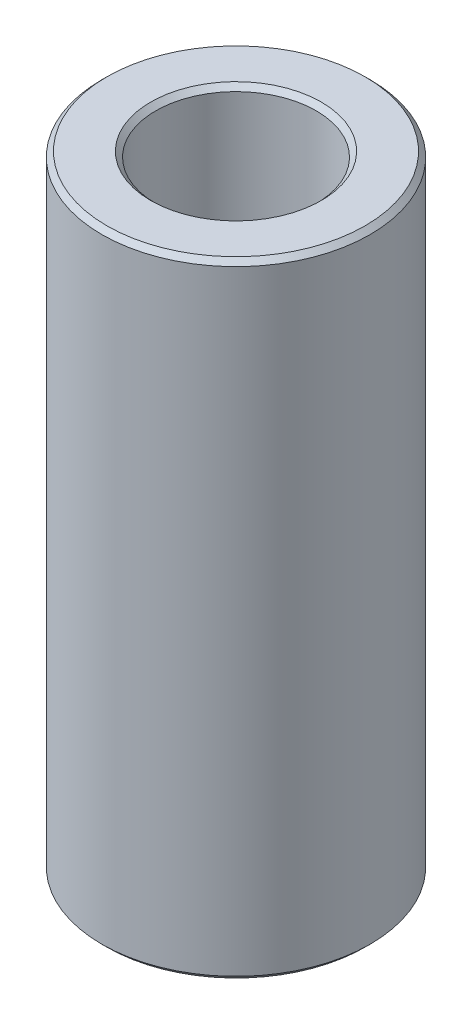
ISO-10303-21;
HEADER;
FILE_DESCRIPTION(('STEP AP214'),'2;1');
FILE_NAME('part.step','',(''),(''),'','','');
FILE_SCHEMA(('AUTOMOTIVE_DESIGN { 1 0 10303 214 1 1 1 1 }'));
ENDSEC;
DATA;
#1=APPLICATION_CONTEXT('core data for automotive mechanical design processes');
#2=APPLICATION_PROTOCOL_DEFINITION('international standard','automotive_design',2000,#1);
#3=PRODUCT_CONTEXT('',#1,'mechanical');
#4=PRODUCT('Part','Part','',(#3));
#5=PRODUCT_RELATED_PRODUCT_CATEGORY('part','',(#4));
#6=PRODUCT_DEFINITION_FORMATION('','',#4);
#7=PRODUCT_DEFINITION_CONTEXT('part definition',#1,'design');
#8=PRODUCT_DEFINITION('design','',#6,#7);
#9=PRODUCT_DEFINITION_SHAPE('','',#8);
#10=(LENGTH_UNIT() NAMED_UNIT(*) SI_UNIT(.MILLI.,.METRE.));
#11=(NAMED_UNIT(*) PLANE_ANGLE_UNIT() SI_UNIT($,.RADIAN.));
#12=(NAMED_UNIT(*) SI_UNIT($,.STERADIAN.) SOLID_ANGLE_UNIT());
#13=UNCERTAINTY_MEASURE_WITH_UNIT(LENGTH_MEASURE(1.E-05),#10,'distance_accuracy_value','');
#14=(GEOMETRIC_REPRESENTATION_CONTEXT(3) GLOBAL_UNCERTAINTY_ASSIGNED_CONTEXT((#13)) GLOBAL_UNIT_ASSIGNED_CONTEXT((#10,
#11,#12)) REPRESENTATION_CONTEXT('',''));
#15=CARTESIAN_POINT('',(0.,0.,0.));
#16=DIRECTION('',(0.,0.,1.));
#17=DIRECTION('',(1.,0.,0.));
#18=AXIS2_PLACEMENT_3D('',#15,#16,#17);
#19=CARTESIAN_POINT('',(0.,221.20355606715,0.));
#20=DIRECTION('',(0.,-1.,0.));
#21=DIRECTION('',(0.,0.,-1.));
#22=AXIS2_PLACEMENT_3D('',#19,#20,#21);
#23=CYLINDRICAL_SURFACE('',#22,47.5);
#24=CARTESIAN_POINT('',(0.,1.78908398316627,0.));
#25=DIRECTION('',(0.,1.,0.));
#26=DIRECTION('',(0.,0.,1.));
#27=AXIS2_PLACEMENT_3D('',#24,#25,#26);
#28=CIRCLE('',#27,47.5);
#29=CARTESIAN_POINT('',(0.,1.78908398316627,-47.5));
#30=VERTEX_POINT('',#29);
#31=EDGE_CURVE('E10',#30,#30,#28,.T.);
#32=CARTESIAN_POINT('',(0.,219.414472083984,0.));
#33=DIRECTION('',(0.,1.,0.));
#34=DIRECTION('',(0.,0.,1.));
#35=AXIS2_PLACEMENT_3D('',#32,#33,#34);
#36=CIRCLE('',#35,47.5);
#37=CARTESIAN_POINT('',(0.,219.414472083984,-47.5));
#38=VERTEX_POINT('',#37);
#39=EDGE_CURVE('E50',#38,#38,#36,.F.);
#40=CARTESIAN_POINT('',(0.,1.78908398316627,-47.5));
#41=CARTESIAN_POINT('',(0.,4.05601510921645,-47.5));
#42=CARTESIAN_POINT('',(0.,6.32294623526665,-47.5));
#43=CARTESIAN_POINT('',(0.,10.856808487367,-47.5));
#44=CARTESIAN_POINT('',(0.,13.1237396134172,-47.5));
#45=CARTESIAN_POINT('',(0.,17.6576018655176,-47.5));
#46=CARTESIAN_POINT('',(0.,19.9245329915678,-47.5));
#47=CARTESIAN_POINT('',(0.,24.4583952436682,-47.5));
#48=CARTESIAN_POINT('',(0.,26.7253263697183,-47.5));
#49=CARTESIAN_POINT('',(0.,31.2591886218187,-47.5));
#50=CARTESIAN_POINT('',(0.,33.5261197478689,-47.5));
#51=CARTESIAN_POINT('',(0.,38.0599819999693,-47.5));
#52=CARTESIAN_POINT('',(0.,40.3269131260195,-47.5));
#53=CARTESIAN_POINT('',(0.,44.8607753781198,-47.5));
#54=CARTESIAN_POINT('',(0.,47.12770650417,-47.5));
#55=CARTESIAN_POINT('',(0.,51.6615687562704,-47.5));
#56=CARTESIAN_POINT('',(0.,53.9284998823206,-47.5));
#57=CARTESIAN_POINT('',(0.,58.462362134421,-47.5));
#58=CARTESIAN_POINT('',(0.,60.7292932604711,-47.5));
#59=CARTESIAN_POINT('',(0.,65.2631555125715,-47.5));
#60=CARTESIAN_POINT('',(0.,67.5300866386217,-47.5));
#61=CARTESIAN_POINT('',(0.,72.0639488907221,-47.5));
#62=CARTESIAN_POINT('',(0.,74.3308800167723,-47.5));
#63=CARTESIAN_POINT('',(0.,78.8647422688726,-47.5));
#64=CARTESIAN_POINT('',(0.,81.1316733949228,-47.5));
#65=CARTESIAN_POINT('',(0.,85.6655356470232,-47.5));
#66=CARTESIAN_POINT('',(0.,87.9324667730734,-47.5));
#67=CARTESIAN_POINT('',(0.,92.4663290251738,-47.5));
#68=CARTESIAN_POINT('',(0.,94.7332601512239,-47.5));
#69=CARTESIAN_POINT('',(0.,99.2671224033243,-47.5));
#70=CARTESIAN_POINT('',(0.,101.534053529375,-47.5));
#71=CARTESIAN_POINT('',(0.,106.067915781475,-47.5));
#72=CARTESIAN_POINT('',(0.,108.334846907525,-47.5));
#73=CARTESIAN_POINT('',(0.,112.868709159625,-47.5));
#74=CARTESIAN_POINT('',(0.,115.135640285676,-47.5));
#75=CARTESIAN_POINT('',(0.,119.669502537776,-47.5));
#76=CARTESIAN_POINT('',(0.,121.936433663826,-47.5));
#77=CARTESIAN_POINT('',(0.,126.470295915927,-47.5));
#78=CARTESIAN_POINT('',(0.,128.737227041977,-47.5));
#79=CARTESIAN_POINT('',(0.,133.271089294077,-47.5));
#80=CARTESIAN_POINT('',(0.,135.538020420127,-47.5));
#81=CARTESIAN_POINT('',(0.,140.071882672228,-47.5));
#82=CARTESIAN_POINT('',(0.,142.338813798278,-47.5));
#83=CARTESIAN_POINT('',(0.,146.872676050378,-47.5));
#84=CARTESIAN_POINT('',(0.,149.139607176428,-47.5));
#85=CARTESIAN_POINT('',(0.,153.673469428529,-47.5));
#86=CARTESIAN_POINT('',(0.,155.940400554579,-47.5));
#87=CARTESIAN_POINT('',(0.,160.474262806679,-47.5));
#88=CARTESIAN_POINT('',(0.,162.74119393273,-47.5));
#89=CARTESIAN_POINT('',(0.,167.27505618483,-47.5));
#90=CARTESIAN_POINT('',(0.,169.54198731088,-47.5));
#91=CARTESIAN_POINT('',(0.,174.075849562981,-47.5));
#92=CARTESIAN_POINT('',(0.,176.342780689031,-47.5));
#93=CARTESIAN_POINT('',(0.,180.876642941131,-47.5));
#94=CARTESIAN_POINT('',(0.,183.143574067181,-47.5));
#95=CARTESIAN_POINT('',(0.,187.677436319282,-47.5));
#96=CARTESIAN_POINT('',(0.,189.944367445332,-47.5));
#97=CARTESIAN_POINT('',(0.,194.478229697432,-47.5));
#98=CARTESIAN_POINT('',(0.,196.745160823482,-47.5));
#99=CARTESIAN_POINT('',(0.,201.279023075583,-47.5));
#100=CARTESIAN_POINT('',(0.,203.545954201633,-47.5));
#101=CARTESIAN_POINT('',(0.,208.079816453733,-47.5));
#102=CARTESIAN_POINT('',(0.,210.346747579784,-47.5));
#103=CARTESIAN_POINT('',(0.,214.880609831884,-47.5));
#104=CARTESIAN_POINT('',(0.,217.147540957934,-47.5));
#105=CARTESIAN_POINT('',(0.,219.414472083984,-47.5));
#106=B_SPLINE_CURVE_WITH_KNOTS('',3,(#40,#41,#42,#43,#44,#45,#46,#47,#48,#49,#50,#51,#52,#53,
#54,#55,#56,#57,#58,#59,#60,#61,#62,#63,#64,#65,#66,#67,#68,#69,#70,#71,#72,#73,#74,#75,#76,#77,
#78,#79,#80,#81,#82,#83,#84,#85,#86,#87,#88,#89,#90,#91,#92,#93,#94,#95,#96,#97,#98,#99,#100,
#101,#102,#103,#104,#105),.UNSPECIFIED.,.F.,.F.,(4,2,2,2,2,2,2,2,2,2,2,2,2,2,2,2,2,2,2,2,2,2,2,
2,2,2,2,2,2,2,2,2,4),(0.,6.80079337815057,13.6015867563011,20.4023801344517,27.2031735126023,
34.0039668907528,40.8047602689034,47.6055536470539,54.4063470252045,61.2071404033551,
68.0079337815056,74.8087271596562,81.6095205378068,88.4103139159573,95.2111072941079,
102.011900672258,108.812694050409,115.61348742856,122.41428080671,129.215074184861,
136.015867563011,142.816660941162,149.617454319312,156.418247697463,163.219041075613,
170.019834453764,176.820627831915,183.621421210065,190.422214588216,197.223007966366,
204.023801344517,210.824594722667,217.625388100818),.UNSPECIFIED.);
#107=EDGE_CURVE('BSEAM39',#30,#38,#106,.T.);
#108=ORIENTED_EDGE('',*,*,#31,.T.);
#109=ORIENTED_EDGE('',*,*,#39,.T.);
#110=ORIENTED_EDGE('',*,*,#107,.T.);
#111=ORIENTED_EDGE('',*,*,#107,.F.);
#112=EDGE_LOOP('',(#108,#110,#109,#111));
#113=FACE_BOUND('',#112,.T.);
#114=ADVANCED_FACE('F39',(#113),#23,.T.);
#115=CARTESIAN_POINT('',(0.,221.20355606715,0.));
#116=DIRECTION('',(0.,1.,0.));
#117=DIRECTION('',(0.,0.,1.));
#118=AXIS2_PLACEMENT_3D('',#115,#116,#117);
#119=PLANE('',#118);
#120=CARTESIAN_POINT('',(0.,221.20355606715,0.));
#121=DIRECTION('',(0.,1.,0.));
#122=DIRECTION('',(0.,0.,1.));
#123=AXIS2_PLACEMENT_3D('',#120,#121,#122);
#124=CIRCLE('',#123,30.2122015407769);
#125=CARTESIAN_POINT('',(0.,221.20355606715,30.2122015407769));
#126=VERTEX_POINT('',#125);
#127=EDGE_CURVE('E58',#126,#126,#124,.F.);
#128=ORIENTED_EDGE('',*,*,#127,.T.);
#129=EDGE_LOOP('',(#128));
#130=FACE_BOUND('',#129,.T.);
#131=CARTESIAN_POINT('',(0.,221.20355606715,0.));
#132=DIRECTION('',(0.,1.,0.));
#133=DIRECTION('',(0.,0.,1.));
#134=AXIS2_PLACEMENT_3D('',#131,#132,#133);
#135=CIRCLE('',#134,45.710916016834);
#136=CARTESIAN_POINT('',(0.,221.20355606715,45.710916016834));
#137=VERTEX_POINT('',#136);
#138=EDGE_CURVE('E61',#137,#137,#135,.T.);
#139=ORIENTED_EDGE('',*,*,#138,.T.);
#140=EDGE_LOOP('',(#139));
#141=FACE_BOUND('',#140,.T.);
#142=ADVANCED_FACE('F88',(#130,#141),#119,.T.);
#143=CARTESIAN_POINT('',(0.,0.,0.));
#144=DIRECTION('',(0.,1.,0.));
#145=DIRECTION('',(0.,0.,1.));
#146=AXIS2_PLACEMENT_3D('',#143,#144,#145);
#147=PLANE('',#146);
#148=CARTESIAN_POINT('',(0.,0.,0.));
#149=DIRECTION('',(0.,1.,0.));
#150=DIRECTION('',(0.,0.,1.));
#151=AXIS2_PLACEMENT_3D('',#148,#149,#150);
#152=CIRCLE('',#151,30.2122015407767);
#153=CARTESIAN_POINT('',(0.,0.,30.2122015407767));
#154=VERTEX_POINT('',#153);
#155=EDGE_CURVE('E51',#154,#154,#152,.T.);
#156=ORIENTED_EDGE('',*,*,#155,.T.);
#157=EDGE_LOOP('',(#156));
#158=FACE_BOUND('',#157,.T.);
#159=CARTESIAN_POINT('',(0.,0.,0.));
#160=DIRECTION('',(0.,1.,0.));
#161=DIRECTION('',(0.,0.,1.));
#162=AXIS2_PLACEMENT_3D('',#159,#160,#161);
#163=CIRCLE('',#162,45.7109160168337);
#164=CARTESIAN_POINT('',(0.,0.,45.7109160168337));
#165=VERTEX_POINT('',#164);
#166=EDGE_CURVE('E54',#165,#165,#163,.F.);
#167=ORIENTED_EDGE('',*,*,#166,.T.);
#168=EDGE_LOOP('',(#167));
#169=FACE_BOUND('',#168,.T.);
#170=ADVANCED_FACE('F83',(#158,#169),#147,.F.);
#171=CARTESIAN_POINT('',(0.,221.20355606715,0.));
#172=DIRECTION('',(0.,-1.,0.));
#173=DIRECTION('',(0.,0.,-1.));
#174=AXIS2_PLACEMENT_3D('',#171,#172,#173);
#175=CYLINDRICAL_SURFACE('',#174,28.4231175576107);
#176=CARTESIAN_POINT('',(0.,219.414472083984,0.));
#177=DIRECTION('',(0.,1.,0.));
#178=DIRECTION('',(0.,0.,1.));
#179=AXIS2_PLACEMENT_3D('',#176,#177,#178);
#180=CIRCLE('',#179,28.4231175576107);
#181=CARTESIAN_POINT('',(0.,219.414472083984,-28.4231175576107));
#182=VERTEX_POINT('',#181);
#183=EDGE_CURVE('E67',#182,#182,#180,.T.);
#184=CARTESIAN_POINT('',(0.,1.78908398316605,0.));
#185=DIRECTION('',(0.,1.,0.));
#186=DIRECTION('',(0.,0.,1.));
#187=AXIS2_PLACEMENT_3D('',#184,#185,#186);
#188=CIRCLE('',#187,28.4231175576107);
#189=CARTESIAN_POINT('',(0.,1.78908398316605,-28.4231175576107));
#190=VERTEX_POINT('',#189);
#191=EDGE_CURVE('E69',#190,#190,#188,.F.);
#192=CARTESIAN_POINT('',(0.,219.414472083984,-28.4231175576107));
#193=CARTESIAN_POINT('',(0.,217.147540957934,-28.4231175576107));
#194=CARTESIAN_POINT('',(0.,214.880609831884,-28.4231175576107));
#195=CARTESIAN_POINT('',(0.,210.346747579783,-28.4231175576107));
#196=CARTESIAN_POINT('',(0.,208.079816453733,-28.4231175576107));
#197=CARTESIAN_POINT('',(0.,203.545954201633,-28.4231175576107));
#198=CARTESIAN_POINT('',(0.,201.279023075583,-28.4231175576107));
#199=CARTESIAN_POINT('',(0.,196.745160823482,-28.4231175576107));
#200=CARTESIAN_POINT('',(0.,194.478229697432,-28.4231175576107));
#201=CARTESIAN_POINT('',(0.,189.944367445332,-28.4231175576107));
#202=CARTESIAN_POINT('',(0.,187.677436319282,-28.4231175576107));
#203=CARTESIAN_POINT('',(0.,183.143574067181,-28.4231175576107));
#204=CARTESIAN_POINT('',(0.,180.876642941131,-28.4231175576107));
#205=CARTESIAN_POINT('',(0.,176.342780689031,-28.4231175576107));
#206=CARTESIAN_POINT('',(0.,174.07584956298,-28.4231175576107));
#207=CARTESIAN_POINT('',(0.,169.54198731088,-28.4231175576107));
#208=CARTESIAN_POINT('',(0.,167.27505618483,-28.4231175576107));
#209=CARTESIAN_POINT('',(0.,162.741193932729,-28.4231175576107));
#210=CARTESIAN_POINT('',(0.,160.474262806679,-28.4231175576107));
#211=CARTESIAN_POINT('',(0.,155.940400554579,-28.4231175576107));
#212=CARTESIAN_POINT('',(0.,153.673469428529,-28.4231175576107));
#213=CARTESIAN_POINT('',(0.,149.139607176428,-28.4231175576107));
#214=CARTESIAN_POINT('',(0.,146.872676050378,-28.4231175576107));
#215=CARTESIAN_POINT('',(0.,142.338813798278,-28.4231175576107));
#216=CARTESIAN_POINT('',(0.,140.071882672228,-28.4231175576107));
#217=CARTESIAN_POINT('',(0.,135.538020420127,-28.4231175576107));
#218=CARTESIAN_POINT('',(0.,133.271089294077,-28.4231175576107));
#219=CARTESIAN_POINT('',(0.,128.737227041977,-28.4231175576107));
#220=CARTESIAN_POINT('',(0.,126.470295915926,-28.4231175576107));
#221=CARTESIAN_POINT('',(0.,121.936433663826,-28.4231175576107));
#222=CARTESIAN_POINT('',(0.,119.669502537776,-28.4231175576107));
#223=CARTESIAN_POINT('',(0.,115.135640285676,-28.4231175576107));
#224=CARTESIAN_POINT('',(0.,112.868709159625,-28.4231175576107));
#225=CARTESIAN_POINT('',(0.,108.334846907525,-28.4231175576107));
#226=CARTESIAN_POINT('',(0.,106.067915781475,-28.4231175576107));
#227=CARTESIAN_POINT('',(0.,101.534053529374,-28.4231175576107));
#228=CARTESIAN_POINT('',(0.,99.2671224033242,-28.4231175576107));
#229=CARTESIAN_POINT('',(0.,94.7332601512238,-28.4231175576107));
#230=CARTESIAN_POINT('',(0.,92.4663290251736,-28.4231175576107));
#231=CARTESIAN_POINT('',(0.,87.9324667730732,-28.4231175576107));
#232=CARTESIAN_POINT('',(0.,85.6655356470231,-28.4231175576107));
#233=CARTESIAN_POINT('',(0.,81.1316733949227,-28.4231175576107));
#234=CARTESIAN_POINT('',(0.,78.8647422688725,-28.4231175576107));
#235=CARTESIAN_POINT('',(0.,74.3308800167721,-28.4231175576107));
#236=CARTESIAN_POINT('',(0.,72.0639488907219,-28.4231175576107));
#237=CARTESIAN_POINT('',(0.,67.5300866386216,-28.4231175576107));
#238=CARTESIAN_POINT('',(0.,65.2631555125714,-28.4231175576107));
#239=CARTESIAN_POINT('',(0.,60.729293260471,-28.4231175576107));
#240=CARTESIAN_POINT('',(0.,58.4623621344208,-28.4231175576107));
#241=CARTESIAN_POINT('',(0.,53.9284998823204,-28.4231175576107));
#242=CARTESIAN_POINT('',(0.,51.6615687562702,-28.4231175576107));
#243=CARTESIAN_POINT('',(0.,47.1277065041698,-28.4231175576107));
#244=CARTESIAN_POINT('',(0.,44.8607753781196,-28.4231175576107));
#245=CARTESIAN_POINT('',(0.,40.3269131260193,-28.4231175576107));
#246=CARTESIAN_POINT('',(0.,38.0599819999691,-28.4231175576107));
#247=CARTESIAN_POINT('',(0.,33.5261197478687,-28.4231175576107));
#248=CARTESIAN_POINT('',(0.,31.2591886218185,-28.4231175576107));
#249=CARTESIAN_POINT('',(0.,26.7253263697181,-28.4231175576107));
#250=CARTESIAN_POINT('',(0.,24.458395243668,-28.4231175576107));
#251=CARTESIAN_POINT('',(0.,19.9245329915676,-28.4231175576107));
#252=CARTESIAN_POINT('',(0.,17.6576018655174,-28.4231175576107));
#253=CARTESIAN_POINT('',(0.,13.123739613417,-28.4231175576107));
#254=CARTESIAN_POINT('',(0.,10.8568084873668,-28.4231175576107));
#255=CARTESIAN_POINT('',(0.,6.32294623526644,-28.4231175576107));
#256=CARTESIAN_POINT('',(0.,4.05601510921624,-28.4231175576107));
#257=CARTESIAN_POINT('',(0.,1.78908398316605,-28.4231175576107));
#258=B_SPLINE_CURVE_WITH_KNOTS('',3,(#192,#193,#194,#195,#196,#197,#198,#199,#200,#201,#202,
#203,#204,#205,#206,#207,#208,#209,#210,#211,#212,#213,#214,#215,#216,#217,#218,#219,#220,#221,
#222,#223,#224,#225,#226,#227,#228,#229,#230,#231,#232,#233,#234,#235,#236,#237,#238,#239,#240,
#241,#242,#243,#244,#245,#246,#247,#248,#249,#250,#251,#252,#253,#254,#255,#256,#257),
.UNSPECIFIED.,.F.,.F.,(4,2,2,2,2,2,2,2,2,2,2,2,2,2,2,2,2,2,2,2,2,2,2,2,2,2,2,2,2,2,2,2,4),(0.,
6.80079337815057,13.6015867563012,20.4023801344517,27.2031735126023,34.0039668907528,
40.8047602689034,47.605553647054,54.4063470252046,61.2071404033551,68.0079337815057,
74.8087271596562,81.6095205378068,88.4103139159574,95.2111072941079,102.011900672259,
108.812694050409,115.61348742856,122.41428080671,129.215074184861,136.015867563011,
142.816660941162,149.617454319312,156.418247697463,163.219041075614,170.019834453764,
176.820627831915,183.621421210065,190.422214588216,197.223007966366,204.023801344517,
210.824594722668,217.625388100818),.UNSPECIFIED.);
#259=EDGE_CURVE('BSEAM71',#182,#190,#258,.T.);
#260=ORIENTED_EDGE('',*,*,#183,.T.);
#261=ORIENTED_EDGE('',*,*,#191,.T.);
#262=ORIENTED_EDGE('',*,*,#259,.T.);
#263=ORIENTED_EDGE('',*,*,#259,.F.);
#264=EDGE_LOOP('',(#260,#262,#261,#263));
#265=FACE_BOUND('',#264,.T.);
#266=ADVANCED_FACE('F71',(#265),#175,.F.);
#267=CARTESIAN_POINT('',(0.,219.414472083984,0.));
#268=DIRECTION('',(0.,1.,0.));
#269=DIRECTION('',(0.,0.,1.));
#270=AXIS2_PLACEMENT_3D('',#267,#268,#269);
#271=CONICAL_SURFACE('',#270,28.4231175576107,0.785398163397451);
#272=ORIENTED_EDGE('',*,*,#127,.F.);
#273=EDGE_LOOP('',(#272));
#274=FACE_BOUND('',#273,.T.);
#275=ORIENTED_EDGE('',*,*,#183,.F.);
#276=EDGE_LOOP('',(#275));
#277=FACE_BOUND('',#276,.T.);
#278=ADVANCED_FACE('F77',(#274,#277),#271,.F.);
#279=CARTESIAN_POINT('',(0.,0.,0.));
#280=DIRECTION('',(0.,-1.,0.));
#281=DIRECTION('',(0.,0.,-1.));
#282=AXIS2_PLACEMENT_3D('',#279,#280,#281);
#283=CONICAL_SURFACE('',#282,30.2122015407767,0.785398163397451);
#284=ORIENTED_EDGE('',*,*,#191,.F.);
#285=EDGE_LOOP('',(#284));
#286=FACE_BOUND('',#285,.T.);
#287=ORIENTED_EDGE('',*,*,#155,.F.);
#288=EDGE_LOOP('',(#287));
#289=FACE_BOUND('',#288,.T.);
#290=ADVANCED_FACE('F73',(#286,#289),#283,.F.);
#291=CARTESIAN_POINT('',(0.,1.78908398316627,0.));
#292=DIRECTION('',(0.,1.,0.));
#293=DIRECTION('',(0.,0.,1.));
#294=AXIS2_PLACEMENT_3D('',#291,#292,#293);
#295=CONICAL_SURFACE('',#294,47.5,0.785398163397458);
#296=ORIENTED_EDGE('',*,*,#166,.F.);
#297=EDGE_LOOP('',(#296));
#298=FACE_BOUND('',#297,.T.);
#299=ORIENTED_EDGE('',*,*,#31,.F.);
#300=EDGE_LOOP('',(#299));
#301=FACE_BOUND('',#300,.T.);
#302=ADVANCED_FACE('F76',(#298,#301),#295,.T.);
#303=CARTESIAN_POINT('',(0.,221.20355606715,0.));
#304=DIRECTION('',(0.,-1.,0.));
#305=DIRECTION('',(0.,0.,-1.));
#306=AXIS2_PLACEMENT_3D('',#303,#304,#305);
#307=CONICAL_SURFACE('',#306,45.710916016834,0.785398163397441);
#308=ORIENTED_EDGE('',*,*,#39,.F.);
#309=EDGE_LOOP('',(#308));
#310=FACE_BOUND('',#309,.T.);
#311=ORIENTED_EDGE('',*,*,#138,.F.);
#312=EDGE_LOOP('',(#311));
#313=FACE_BOUND('',#312,.T.);
#314=ADVANCED_FACE('F45',(#310,#313),#307,.T.);
#315=CLOSED_SHELL('',(#114,#142,#170,#266,#278,#290,#302,#314));
#316=MANIFOLD_SOLID_BREP('B2',#315);
#317=ADVANCED_BREP_SHAPE_REPRESENTATION('',(#18,#316),#14);
#318=SHAPE_DEFINITION_REPRESENTATION(#9,#317);
ENDSEC;
END-ISO-10303-21;
